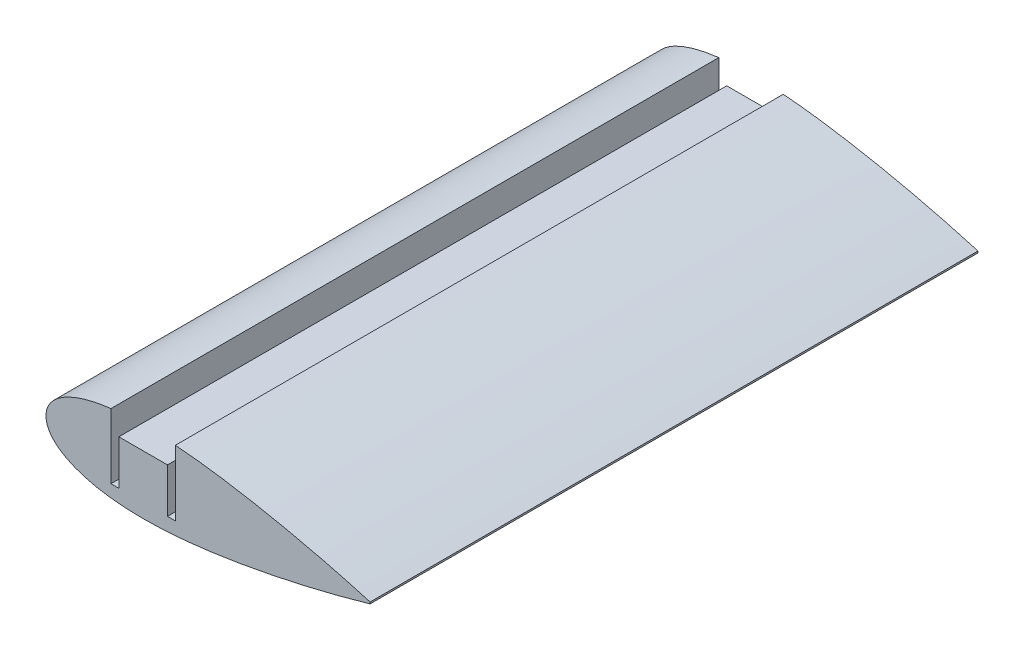
ISO-10303-21;
HEADER;
FILE_DESCRIPTION(('STEP AP214'),'2;1');
FILE_NAME('part.step','',(''),(''),'','','');
FILE_SCHEMA(('AUTOMOTIVE_DESIGN { 1 0 10303 214 1 1 1 1 }'));
ENDSEC;
DATA;
#1=APPLICATION_CONTEXT('core data for automotive mechanical design processes');
#2=APPLICATION_PROTOCOL_DEFINITION('international standard','automotive_design',2000,#1);
#3=PRODUCT_CONTEXT('',#1,'mechanical');
#4=PRODUCT('Part','Part','',(#3));
#5=PRODUCT_RELATED_PRODUCT_CATEGORY('part','',(#4));
#6=PRODUCT_DEFINITION_FORMATION('','',#4);
#7=PRODUCT_DEFINITION_CONTEXT('part definition',#1,'design');
#8=PRODUCT_DEFINITION('design','',#6,#7);
#9=PRODUCT_DEFINITION_SHAPE('','',#8);
#10=(LENGTH_UNIT() NAMED_UNIT(*) SI_UNIT(.MILLI.,.METRE.));
#11=(NAMED_UNIT(*) PLANE_ANGLE_UNIT() SI_UNIT($,.RADIAN.));
#12=(NAMED_UNIT(*) SI_UNIT($,.STERADIAN.) SOLID_ANGLE_UNIT());
#13=UNCERTAINTY_MEASURE_WITH_UNIT(LENGTH_MEASURE(1.E-05),#10,'distance_accuracy_value','');
#14=(GEOMETRIC_REPRESENTATION_CONTEXT(3) GLOBAL_UNCERTAINTY_ASSIGNED_CONTEXT((#13)) GLOBAL_UNIT_ASSIGNED_CONTEXT((#10,
#11,#12)) REPRESENTATION_CONTEXT('',''));
#15=CARTESIAN_POINT('',(0.,0.,0.));
#16=DIRECTION('',(0.,0.,1.));
#17=DIRECTION('',(1.,0.,0.));
#18=AXIS2_PLACEMENT_3D('',#15,#16,#17);
#19=CARTESIAN_POINT('',(55.9989919193493,0.209938863085076,150.));
#20=CARTESIAN_POINT('',(53.4638964966378,0.950455213569446,150.));
#21=CARTESIAN_POINT('',(48.8039042583549,2.23387389684317,150.));
#22=CARTESIAN_POINT('',(42.4289239083546,3.81993488404164,150.));
#23=CARTESIAN_POINT('',(36.7433768309172,5.12087345257297,150.));
#24=CARTESIAN_POINT('',(31.199749361999,6.28724939568446,150.));
#25=CARTESIAN_POINT('',(25.282426202672,7.40748841907212,150.));
#26=CARTESIAN_POINT('',(20.1764843732921,8.24523101459941,150.));
#27=CARTESIAN_POINT('',(14.9796239544358,8.97488730570402,150.));
#28=CARTESIAN_POINT('',(10.821499068855,9.448623319597,150.));
#29=CARTESIAN_POINT('',(6.69735098701538,9.77702289368401,150.));
#30=CARTESIAN_POINT('',(3.68065560441313,9.9396226054484,150.));
#31=CARTESIAN_POINT('',(0.739619612666901,10.0126657259053,150.));
#32=CARTESIAN_POINT('',(-2.10775121270018,9.99002894364164,150.));
#33=CARTESIAN_POINT('',(-4.84394170477697,9.86696098204471,150.));
#34=CARTESIAN_POINT('',(-7.45218804783977,9.64089989695852,150.));
#35=CARTESIAN_POINT('',(-9.91647870541163,9.31063074400066,150.));
#36=CARTESIAN_POINT('',(-12.2217517660549,8.87722299298465,150.));
#37=CARTESIAN_POINT('',(-14.3540217517739,8.3436594333454,150.));
#38=CARTESIAN_POINT('',(-16.3004013447247,7.71434115945919,150.));
#39=CARTESIAN_POINT('',(-18.0493555178327,6.99539951409285,150.));
#40=CARTESIAN_POINT('',(-19.5906051636423,6.19339349001841,150.));
#41=CARTESIAN_POINT('',(-20.9154102376862,5.31556202706807,150.));
#42=CARTESIAN_POINT('',(-22.0158536973899,4.36806482887196,150.));
#43=CARTESIAN_POINT('',(-22.8849211839651,3.3564916522408,150.));
#44=CARTESIAN_POINT('',(-23.5144514570847,2.28497610959955,150.));
#45=CARTESIAN_POINT('',(-23.8953726240987,1.15878899111641,150.));
#46=CARTESIAN_POINT('',(-24.0186796636969,-1.75908521777257E-13,150.));
#47=CARTESIAN_POINT('',(-23.8953726240988,-1.15878899111675,150.));
#48=CARTESIAN_POINT('',(-23.5144514570847,-2.28497610959989,150.));
#49=CARTESIAN_POINT('',(-22.884921183965,-3.35649165224111,150.));
#50=CARTESIAN_POINT('',(-22.0158536973898,-4.36806482887224,150.));
#51=CARTESIAN_POINT('',(-20.915410237686,-5.3155620270683,150.));
#52=CARTESIAN_POINT('',(-19.5906051636421,-6.19339349001866,150.));
#53=CARTESIAN_POINT('',(-18.0493555178326,-6.99539951409303,150.));
#54=CARTESIAN_POINT('',(-16.3004013447245,-7.7143411594593,150.));
#55=CARTESIAN_POINT('',(-14.3540217517738,-8.34365943334548,150.));
#56=CARTESIAN_POINT('',(-12.2217517660546,-8.87722299298468,150.));
#57=CARTESIAN_POINT('',(-9.91647870541153,-9.31063074400058,150.));
#58=CARTESIAN_POINT('',(-7.45218804783928,-9.64089989695837,150.));
#59=CARTESIAN_POINT('',(-4.84394170477671,-9.86696098204449,150.));
#60=CARTESIAN_POINT('',(-2.10775121269992,-9.9900289436414,150.));
#61=CARTESIAN_POINT('',(0.739619612667124,-10.0126657259049,150.));
#62=CARTESIAN_POINT('',(3.68065560441341,-9.93962260544802,150.));
#63=CARTESIAN_POINT('',(7.74070186985012,-9.72078633967261,150.));
#64=CARTESIAN_POINT('',(12.9128329822487,-9.24133423758695,150.));
#65=CARTESIAN_POINT('',(19.1366713132933,-8.41575446947586,150.));
#66=CARTESIAN_POINT('',(25.2824253698515,-7.40744897655412,150.));
#67=CARTESIAN_POINT('',(31.1997526672966,-6.28725230429911,150.));
#68=CARTESIAN_POINT('',(37.5171609466784,-4.95809921986488,150.));
#69=CARTESIAN_POINT('',(44.7425708724751,-3.27585727198836,150.));
#70=CARTESIAN_POINT('',(51.057566094569,-1.62626062854624,150.));
#71=CARTESIAN_POINT('',(54.9450257220016,-0.517808616230064,150.));
#72=CARTESIAN_POINT('',(55.9579115196256,-0.221938690548135,150.));
#73=CARTESIAN_POINT('',(55.9989919193493,-0.209938863083146,150.));
#74=B_SPLINE_CURVE_WITH_KNOTS('',3,(#19,#20,#21,#22,#23,#24,#25,#26,#27,#28,#29,#30,#31,#32,#33,
#34,#35,#36,#37,#38,#39,#40,#41,#42,#43,#44,#45,#46,#47,#48,#49,#50,#51,#52,#53,#54,#55,#56,#57,
#58,#59,#60,#61,#62,#63,#64,#65,#66,#67,#68,#69,#70,#71,#72,#73),.UNSPECIFIED.,.F.,.F.,(4,1,1,1,
1,1,1,1,1,1,1,1,1,1,1,1,1,1,1,1,1,1,1,1,1,1,1,1,1,1,1,1,1,1,1,1,1,1,1,1,1,1,1,1,1,1,1,1,1,1,1,1,
4),(0.,0.046554702548103,0.0851933723553801,0.115793222339596,0.149362634078918,0.1850479898127,
0.221946042476896,0.240561294663547,0.277549679499533,0.295701184971201,0.313482549842361,
0.330796889450606,0.347551895237421,0.36366584186233,0.379065349030513,0.393686065347915,
0.407475418245897,0.42039193375361,0.432405656844922,0.443502805927447,0.45368642125852,
0.462984388050073,0.471455944432899,0.479204464756735,0.48638826860332,0.493228973887645,0.5,
0.506771026112355,0.51361173139668,0.520795535243265,0.528544055567101,0.537015611949927,
0.54631357874148,0.556497194072553,0.567594343155078,0.579608066246389,0.592524581754103,
0.606313934652085,0.620934650969486,0.63633415813767,0.652448104762579,0.669203110549394,
0.686517450157639,0.704298815028799,0.740866340835607,0.778053957523103,0.8149520101873,
0.850637365921082,0.884206777660403,0.928744289385696,0.981399281225805,0.999245596133163,1.),.UNSPECIFIED.);
#75=DIRECTION('',(0.,0.,-1.));
#76=VECTOR('',#75,1.);
#77=SURFACE_OF_LINEAR_EXTRUSION('',#74,#76);
#78=CARTESIAN_POINT('',(55.9989919193493,0.209938863085076,0.));
#79=CARTESIAN_POINT('',(53.4638964966378,0.950455213569446,0.));
#80=CARTESIAN_POINT('',(48.8039042583549,2.23387389684317,0.));
#81=CARTESIAN_POINT('',(42.4289239083546,3.81993488404164,0.));
#82=CARTESIAN_POINT('',(36.7433768309172,5.12087345257297,0.));
#83=CARTESIAN_POINT('',(31.199749361999,6.28724939568446,0.));
#84=CARTESIAN_POINT('',(25.282426202672,7.40748841907212,0.));
#85=CARTESIAN_POINT('',(20.1764843732921,8.24523101459941,0.));
#86=CARTESIAN_POINT('',(14.9796239544358,8.97488730570402,0.));
#87=CARTESIAN_POINT('',(10.821499068855,9.448623319597,0.));
#88=CARTESIAN_POINT('',(6.69735098701538,9.77702289368401,0.));
#89=CARTESIAN_POINT('',(3.68065560441313,9.9396226054484,0.));
#90=CARTESIAN_POINT('',(0.739619612666901,10.0126657259053,0.));
#91=CARTESIAN_POINT('',(-2.10775121270018,9.99002894364164,0.));
#92=CARTESIAN_POINT('',(-4.84394170477697,9.86696098204471,0.));
#93=CARTESIAN_POINT('',(-7.45218804783977,9.64089989695852,0.));
#94=CARTESIAN_POINT('',(-9.91647870541163,9.31063074400066,0.));
#95=CARTESIAN_POINT('',(-12.2217517660549,8.87722299298465,0.));
#96=CARTESIAN_POINT('',(-14.3540217517739,8.3436594333454,0.));
#97=CARTESIAN_POINT('',(-16.3004013447247,7.71434115945919,0.));
#98=CARTESIAN_POINT('',(-18.0493555178327,6.99539951409285,0.));
#99=CARTESIAN_POINT('',(-19.5906051636423,6.19339349001841,0.));
#100=CARTESIAN_POINT('',(-20.9154102376862,5.31556202706807,0.));
#101=CARTESIAN_POINT('',(-22.0158536973899,4.36806482887196,0.));
#102=CARTESIAN_POINT('',(-22.8849211839651,3.3564916522408,0.));
#103=CARTESIAN_POINT('',(-23.5144514570847,2.28497610959955,0.));
#104=CARTESIAN_POINT('',(-23.8953726240987,1.15878899111641,0.));
#105=CARTESIAN_POINT('',(-24.0186796636969,-1.75908521777257E-13,0.));
#106=CARTESIAN_POINT('',(-23.8953726240988,-1.15878899111675,0.));
#107=CARTESIAN_POINT('',(-23.5144514570847,-2.28497610959989,0.));
#108=CARTESIAN_POINT('',(-22.884921183965,-3.35649165224111,0.));
#109=CARTESIAN_POINT('',(-22.0158536973898,-4.36806482887224,0.));
#110=CARTESIAN_POINT('',(-20.915410237686,-5.3155620270683,0.));
#111=CARTESIAN_POINT('',(-19.5906051636421,-6.19339349001866,0.));
#112=CARTESIAN_POINT('',(-18.0493555178326,-6.99539951409303,0.));
#113=CARTESIAN_POINT('',(-16.3004013447245,-7.7143411594593,0.));
#114=CARTESIAN_POINT('',(-14.3540217517738,-8.34365943334548,0.));
#115=CARTESIAN_POINT('',(-12.2217517660546,-8.87722299298468,0.));
#116=CARTESIAN_POINT('',(-9.91647870541153,-9.31063074400058,0.));
#117=CARTESIAN_POINT('',(-7.45218804783928,-9.64089989695837,0.));
#118=CARTESIAN_POINT('',(-4.84394170477671,-9.86696098204449,0.));
#119=CARTESIAN_POINT('',(-2.10775121269992,-9.9900289436414,0.));
#120=CARTESIAN_POINT('',(0.739619612667124,-10.0126657259049,0.));
#121=CARTESIAN_POINT('',(3.68065560441341,-9.93962260544802,0.));
#122=CARTESIAN_POINT('',(7.74070186985012,-9.72078633967261,0.));
#123=CARTESIAN_POINT('',(12.9128329822487,-9.24133423758695,0.));
#124=CARTESIAN_POINT('',(19.1366713132933,-8.41575446947586,0.));
#125=CARTESIAN_POINT('',(25.2824253698515,-7.40744897655412,0.));
#126=CARTESIAN_POINT('',(31.1997526672966,-6.28725230429911,0.));
#127=CARTESIAN_POINT('',(37.5171609466784,-4.95809921986488,0.));
#128=CARTESIAN_POINT('',(44.7425708724751,-3.27585727198836,0.));
#129=CARTESIAN_POINT('',(51.057566094569,-1.62626062854624,0.));
#130=CARTESIAN_POINT('',(54.9450257220016,-0.517808616230064,0.));
#131=CARTESIAN_POINT('',(55.9579115196256,-0.221938690548135,0.));
#132=CARTESIAN_POINT('',(55.9989919193493,-0.209938863083146,0.));
#133=B_SPLINE_CURVE_WITH_KNOTS('',3,(#78,#79,#80,#81,#82,#83,#84,#85,#86,#87,#88,#89,#90,#91,
#92,#93,#94,#95,#96,#97,#98,#99,#100,#101,#102,#103,#104,#105,#106,#107,#108,#109,#110,#111,
#112,#113,#114,#115,#116,#117,#118,#119,#120,#121,#122,#123,#124,#125,#126,#127,#128,#129,#130,
#131,#132),.UNSPECIFIED.,.F.,.F.,(4,1,1,1,1,1,1,1,1,1,1,1,1,1,1,1,1,1,1,1,1,1,1,1,1,1,1,1,1,1,1,
1,1,1,1,1,1,1,1,1,1,1,1,1,1,1,1,1,1,1,1,1,4),(0.,0.046554702548103,0.0851933723553801,
0.115793222339596,0.149362634078918,0.1850479898127,0.221946042476896,0.240561294663547,
0.277549679499533,0.295701184971201,0.313482549842361,0.330796889450606,0.347551895237421,
0.36366584186233,0.379065349030513,0.393686065347915,0.407475418245897,0.42039193375361,
0.432405656844922,0.443502805927447,0.45368642125852,0.462984388050073,0.471455944432899,
0.479204464756735,0.48638826860332,0.493228973887645,0.5,0.506771026112355,0.51361173139668,
0.520795535243265,0.528544055567101,0.537015611949927,0.54631357874148,0.556497194072553,
0.567594343155078,0.579608066246389,0.592524581754103,0.606313934652085,0.620934650969486,
0.63633415813767,0.652448104762579,0.669203110549394,0.686517450157639,0.704298815028799,
0.740866340835607,0.778053957523103,0.8149520101873,0.850637365921082,0.884206777660403,
0.928744289385696,0.981399281225805,0.999245596133163,1.),.UNSPECIFIED.);
#134=CARTESIAN_POINT('',(55.9989919193493,0.209938863085006,0.));
#135=VERTEX_POINT('',#134);
#136=CARTESIAN_POINT('',(7.95,9.67376392846105,0.));
#137=VERTEX_POINT('',#136);
#138=EDGE_CURVE('E91',#135,#137,#133,.T.);
#139=ORIENTED_EDGE('',*,*,#138,.T.);
#140=DIRECTION('',(0.,0.,-1.));
#141=VECTOR('',#140,1.);
#142=CARTESIAN_POINT('',(7.95,9.67376392846105,75.0005));
#143=LINE('',#142,#141);
#144=CARTESIAN_POINT('',(7.95000022217772,9.67320604176941,150.));
#145=VERTEX_POINT('',#144);
#146=EDGE_CURVE('E305',#145,#137,#143,.T.);
#147=ORIENTED_EDGE('',*,*,#146,.F.);
#148=CARTESIAN_POINT('',(7.95004296781648,9.67376061658568,150.));
#149=CARTESIAN_POINT('',(8.55206981624657,9.62735745972923,150.));
#150=CARTESIAN_POINT('',(11.2447846059229,9.40039831227111,150.));
#151=CARTESIAN_POINT('',(14.9796239544358,8.97488730570402,150.));
#152=CARTESIAN_POINT('',(20.1764843732921,8.24523101459941,150.));
#153=CARTESIAN_POINT('',(25.282426202672,7.40748841907212,150.));
#154=CARTESIAN_POINT('',(31.199749361999,6.28724939568446,150.));
#155=CARTESIAN_POINT('',(36.7433768309172,5.12087345257297,150.));
#156=CARTESIAN_POINT('',(42.4289239083546,3.81993488404164,150.));
#157=CARTESIAN_POINT('',(48.8039042583549,2.23387389684317,150.));
#158=CARTESIAN_POINT('',(53.4638964966378,0.950455213569446,150.));
#159=CARTESIAN_POINT('',(55.9989919193493,0.209938863085076,150.));
#160=B_SPLINE_CURVE_WITH_KNOTS('',3,(#148,#149,#150,#151,#152,#153,#154,#155,#156,#157,#158,
#159),.UNSPECIFIED.,.F.,.F.,(4,1,1,1,1,1,1,1,1,4),(0.,0.0106434373012104,0.0476318221371959,
0.0662470743238466,0.103145126988043,0.138830482721825,0.172399894461147,0.202999744445363,
0.24163841425264,0.288193116800743),.UNSPECIFIED.);
#161=CARTESIAN_POINT('',(55.9989919193493,0.209938863085006,150.));
#162=VERTEX_POINT('',#161);
#163=EDGE_CURVE('E97',#162,#145,#160,.F.);
#164=ORIENTED_EDGE('',*,*,#163,.F.);
#165=DIRECTION('',(0.,0.,-1.));
#166=VECTOR('',#165,1.);
#167=CARTESIAN_POINT('',(55.9989919193493,0.209938863085006,150.));
#168=LINE('',#167,#166);
#169=EDGE_CURVE('E53',#162,#135,#168,.T.);
#170=ORIENTED_EDGE('',*,*,#169,.T.);
#171=EDGE_LOOP('',(#139,#147,#164,#170));
#172=FACE_BOUND('',#171,.T.);
#173=ADVANCED_FACE('F41',(#172),#77,.F.);
#174=CARTESIAN_POINT('',(55.9989919193493,-0.209938863083146,150.));
#175=CARTESIAN_POINT('',(55.9579115196256,-0.221938690548135,150.));
#176=CARTESIAN_POINT('',(54.9450257220016,-0.517808616230064,150.));
#177=CARTESIAN_POINT('',(51.057566094569,-1.62626062854624,150.));
#178=CARTESIAN_POINT('',(44.7425708724751,-3.27585727198836,150.));
#179=CARTESIAN_POINT('',(37.5171609466784,-4.95809921986488,150.));
#180=CARTESIAN_POINT('',(31.1997526672966,-6.28725230429911,150.));
#181=CARTESIAN_POINT('',(25.2824253698515,-7.40744897655412,150.));
#182=CARTESIAN_POINT('',(19.1366713132933,-8.41575446947586,150.));
#183=CARTESIAN_POINT('',(12.9128329822487,-9.24133423758695,150.));
#184=CARTESIAN_POINT('',(7.74070186985012,-9.72078633967261,150.));
#185=CARTESIAN_POINT('',(3.68065560441341,-9.93962260544802,150.));
#186=CARTESIAN_POINT('',(0.739619612667124,-10.0126657259049,150.));
#187=CARTESIAN_POINT('',(-2.10775121269992,-9.9900289436414,150.));
#188=CARTESIAN_POINT('',(-4.84394170477671,-9.86696098204449,150.));
#189=CARTESIAN_POINT('',(-7.45218804783928,-9.64089989695837,150.));
#190=CARTESIAN_POINT('',(-9.91647870541153,-9.31063074400058,150.));
#191=CARTESIAN_POINT('',(-12.2217517660546,-8.87722299298468,150.));
#192=CARTESIAN_POINT('',(-14.3540217517738,-8.34365943334548,150.));
#193=CARTESIAN_POINT('',(-16.3004013447245,-7.7143411594593,150.));
#194=CARTESIAN_POINT('',(-18.0493555178326,-6.99539951409303,150.));
#195=CARTESIAN_POINT('',(-19.5906051636421,-6.19339349001866,150.));
#196=CARTESIAN_POINT('',(-20.915410237686,-5.3155620270683,150.));
#197=CARTESIAN_POINT('',(-22.0158536973898,-4.36806482887224,150.));
#198=CARTESIAN_POINT('',(-22.884921183965,-3.35649165224111,150.));
#199=CARTESIAN_POINT('',(-23.5144514570847,-2.28497610959989,150.));
#200=CARTESIAN_POINT('',(-23.8953726240988,-1.15878899111675,150.));
#201=CARTESIAN_POINT('',(-24.0186796636969,-1.75908521777257E-13,150.));
#202=CARTESIAN_POINT('',(-23.8953726240987,1.15878899111641,150.));
#203=CARTESIAN_POINT('',(-23.5144514570847,2.28497610959955,150.));
#204=CARTESIAN_POINT('',(-22.8849211839651,3.3564916522408,150.));
#205=CARTESIAN_POINT('',(-22.0158536973899,4.36806482887196,150.));
#206=CARTESIAN_POINT('',(-20.9154102376862,5.31556202706807,150.));
#207=CARTESIAN_POINT('',(-19.5906051636423,6.19339349001841,150.));
#208=CARTESIAN_POINT('',(-18.0493555178327,6.99539951409285,150.));
#209=CARTESIAN_POINT('',(-16.3004013447247,7.71434115945919,150.));
#210=CARTESIAN_POINT('',(-14.3540217517739,8.3436594333454,150.));
#211=CARTESIAN_POINT('',(-12.2217517660549,8.87722299298465,150.));
#212=CARTESIAN_POINT('',(-10.0669225668256,9.2823462267594,150.));
#213=CARTESIAN_POINT('',(-8.62170436038093,9.48338797999524,150.));
#214=CARTESIAN_POINT('',(-7.94998790313957,9.56370201604713,150.));
#215=B_SPLINE_CURVE_WITH_KNOTS('',3,(#174,#175,#176,#177,#178,#179,#180,#181,#182,#183,#184,
#185,#186,#187,#188,#189,#190,#191,#192,#193,#194,#195,#196,#197,#198,#199,#200,#201,#202,#203,
#204,#205,#206,#207,#208,#209,#210,#211,#212,#213,#214),.UNSPECIFIED.,.F.,.F.,(4,1,1,1,1,1,1,1,
1,1,1,1,1,1,1,1,1,1,1,1,1,1,1,1,1,1,1,1,1,1,1,1,1,1,1,1,1,1,4),(0.381762353168956,
0.382516757035792,0.40036307194315,0.453018063783259,0.497555575508552,0.531124987247873,
0.566810342981656,0.603708395645852,0.640896012333348,0.677463538140157,0.695244903011317,
0.712559242619562,0.729314248406377,0.745428195031286,0.760827702199469,0.775448418516871,
0.789237771414852,0.802154286922566,0.814168010013878,0.825265159096403,0.835448774427476,
0.844746741219029,0.853218297601854,0.860966817925691,0.868150621772276,0.8749913270566,
0.881762353168956,0.888533379281311,0.895374084565636,0.902557888412221,0.910306408736057,
0.918777965118882,0.928075931910435,0.938259547241509,0.949356696324034,0.961370419415345,
0.974286934923059,0.988076287821041,1.),.UNSPECIFIED.);
#216=CARTESIAN_POINT('',(-7.9499999621112,9.56378591811171,150.000165217242));
#217=VERTEX_POINT('',#216);
#218=CARTESIAN_POINT('',(55.9989919193493,-0.209938863083216,150.));
#219=VERTEX_POINT('',#218);
#220=EDGE_CURVE('E90',#217,#219,#215,.F.);
#221=ORIENTED_EDGE('',*,*,#220,.F.);
#222=DIRECTION('',(0.,0.,-1.));
#223=VECTOR('',#222,1.);
#224=CARTESIAN_POINT('',(-7.94999999999999,9.56370056967996,75.0005));
#225=LINE('',#224,#223);
#226=CARTESIAN_POINT('',(-7.94999999999999,9.56370056967996,0.));
#227=VERTEX_POINT('',#226);
#228=EDGE_CURVE('E306',#217,#227,#225,.T.);
#229=ORIENTED_EDGE('',*,*,#228,.T.);
#230=CARTESIAN_POINT('',(55.9989919193493,-0.209938863083216,0.));
#231=VERTEX_POINT('',#230);
#232=EDGE_CURVE('E105',#227,#231,#133,.T.);
#233=ORIENTED_EDGE('',*,*,#232,.T.);
#234=DIRECTION('',(0.,0.,-1.));
#235=VECTOR('',#234,1.);
#236=CARTESIAN_POINT('',(55.9989919193493,-0.209938863083216,150.));
#237=LINE('',#236,#235);
#238=EDGE_CURVE('E11',#219,#231,#237,.T.);
#239=ORIENTED_EDGE('',*,*,#238,.F.);
#240=EDGE_LOOP('',(#221,#229,#233,#239));
#241=FACE_BOUND('',#240,.T.);
#242=ADVANCED_FACE('F43',(#241),#77,.F.);
#243=CARTESIAN_POINT('',(55.9989919193493,0.209938863085006,150.));
#244=DIRECTION('',(-1.,0.,0.));
#245=DIRECTION('',(0.,0.,1.));
#246=AXIS2_PLACEMENT_3D('',#243,#244,#245);
#247=PLANE('',#246);
#248=DIRECTION('',(0.,1.,0.));
#249=VECTOR('',#248,1.);
#250=CARTESIAN_POINT('',(55.9989919193493,0.209938863085006,0.));
#251=LINE('',#250,#249);
#252=EDGE_CURVE('E82',#231,#135,#251,.T.);
#253=ORIENTED_EDGE('',*,*,#252,.T.);
#254=ORIENTED_EDGE('',*,*,#169,.F.);
#255=DIRECTION('',(0.,1.,0.));
#256=VECTOR('',#255,1.);
#257=CARTESIAN_POINT('',(55.9989919193493,0.209938863085006,150.));
#258=LINE('',#257,#256);
#259=EDGE_CURVE('E70',#219,#162,#258,.T.);
#260=ORIENTED_EDGE('',*,*,#259,.F.);
#261=ORIENTED_EDGE('',*,*,#238,.T.);
#262=EDGE_LOOP('',(#253,#254,#260,#261));
#263=FACE_BOUND('',#262,.T.);
#264=ADVANCED_FACE('F84',(#263),#247,.F.);
#265=CARTESIAN_POINT('',(-23.9777178269784,-1.93472177114595E-13,150.));
#266=DIRECTION('',(0.,0.,-1.));
#267=DIRECTION('',(-1.,0.,0.));
#268=AXIS2_PLACEMENT_3D('',#265,#266,#267);
#269=PLANE('',#268);
#270=ORIENTED_EDGE('',*,*,#163,.T.);
#271=DIRECTION('',(0.,1.,0.));
#272=VECTOR('',#271,1.);
#273=CARTESIAN_POINT('',(7.95,-6.49999999999986,150.));
#274=LINE('',#273,#272);
#275=CARTESIAN_POINT('',(7.95,-6.49999999999986,150.));
#276=VERTEX_POINT('',#275);
#277=EDGE_CURVE('E275',#276,#145,#274,.T.);
#278=ORIENTED_EDGE('',*,*,#277,.F.);
#279=DIRECTION('',(1.,0.,0.));
#280=VECTOR('',#279,1.);
#281=CARTESIAN_POINT('',(6.,-6.49999999999986,150.));
#282=LINE('',#281,#280);
#283=CARTESIAN_POINT('',(6.,-6.49999999999986,150.));
#284=VERTEX_POINT('',#283);
#285=EDGE_CURVE('E272',#284,#276,#282,.T.);
#286=ORIENTED_EDGE('',*,*,#285,.F.);
#287=DIRECTION('',(0.,-1.,0.));
#288=VECTOR('',#287,1.);
#289=CARTESIAN_POINT('',(6.,-6.49999999999986,150.));
#290=LINE('',#289,#288);
#291=CARTESIAN_POINT('',(6.,4.50000000000014,150.));
#292=VERTEX_POINT('',#291);
#293=EDGE_CURVE('E263',#292,#284,#290,.T.);
#294=ORIENTED_EDGE('',*,*,#293,.F.);
#295=DIRECTION('',(1.,0.,0.));
#296=VECTOR('',#295,1.);
#297=CARTESIAN_POINT('',(6.,4.50000000000014,150.));
#298=LINE('',#297,#296);
#299=CARTESIAN_POINT('',(-6.,4.50000000000014,150.));
#300=VERTEX_POINT('',#299);
#301=EDGE_CURVE('E260',#300,#292,#298,.T.);
#302=ORIENTED_EDGE('',*,*,#301,.F.);
#303=DIRECTION('',(0.,1.,0.));
#304=VECTOR('',#303,1.);
#305=CARTESIAN_POINT('',(-6.,-6.49999999999986,150.));
#306=LINE('',#305,#304);
#307=CARTESIAN_POINT('',(-6.,-6.49999999999986,150.));
#308=VERTEX_POINT('',#307);
#309=EDGE_CURVE('E253',#308,#300,#306,.T.);
#310=ORIENTED_EDGE('',*,*,#309,.F.);
#311=DIRECTION('',(1.,0.,0.));
#312=VECTOR('',#311,1.);
#313=CARTESIAN_POINT('',(-6.,-6.49999999999986,150.));
#314=LINE('',#313,#312);
#315=CARTESIAN_POINT('',(-7.95,-6.49999999999986,150.));
#316=VERTEX_POINT('',#315);
#317=EDGE_CURVE('E107',#316,#308,#314,.T.);
#318=ORIENTED_EDGE('',*,*,#317,.F.);
#319=DIRECTION('',(0.,-1.,0.));
#320=VECTOR('',#319,1.);
#321=CARTESIAN_POINT('',(-7.95,-6.49999999999986,150.));
#322=LINE('',#321,#320);
#323=EDGE_CURVE('E261',#217,#316,#322,.T.);
#324=ORIENTED_EDGE('',*,*,#323,.F.);
#325=ORIENTED_EDGE('',*,*,#220,.T.);
#326=ORIENTED_EDGE('',*,*,#259,.T.);
#327=EDGE_LOOP('',(#270,#278,#286,#294,#302,#310,#318,#324,#325,#326));
#328=FACE_BOUND('',#327,.T.);
#329=ADVANCED_FACE('F124',(#328),#269,.F.);
#330=CARTESIAN_POINT('',(-23.9777178269784,-1.93472177114595E-13,0.));
#331=DIRECTION('',(0.,0.,-1.));
#332=DIRECTION('',(-1.,0.,0.));
#333=AXIS2_PLACEMENT_3D('',#330,#331,#332);
#334=PLANE('',#333);
#335=DIRECTION('',(0.,-1.,0.));
#336=VECTOR('',#335,1.);
#337=CARTESIAN_POINT('',(7.95,-6.49999999999986,0.));
#338=LINE('',#337,#336);
#339=CARTESIAN_POINT('',(7.95,-6.49999999999986,0.));
#340=VERTEX_POINT('',#339);
#341=EDGE_CURVE('E104',#137,#340,#338,.T.);
#342=ORIENTED_EDGE('',*,*,#341,.F.);
#343=ORIENTED_EDGE('',*,*,#138,.F.);
#344=ORIENTED_EDGE('',*,*,#252,.F.);
#345=ORIENTED_EDGE('',*,*,#232,.F.);
#346=DIRECTION('',(0.,1.,0.));
#347=VECTOR('',#346,1.);
#348=CARTESIAN_POINT('',(-7.95,-6.49999999999986,0.));
#349=LINE('',#348,#347);
#350=CARTESIAN_POINT('',(-7.95,-6.49999999999986,0.));
#351=VERTEX_POINT('',#350);
#352=EDGE_CURVE('E283',#351,#227,#349,.T.);
#353=ORIENTED_EDGE('',*,*,#352,.F.);
#354=DIRECTION('',(-1.,0.,0.));
#355=VECTOR('',#354,1.);
#356=CARTESIAN_POINT('',(-6.,-6.49999999999986,0.));
#357=LINE('',#356,#355);
#358=CARTESIAN_POINT('',(-6.,-6.49999999999986,0.));
#359=VERTEX_POINT('',#358);
#360=EDGE_CURVE('E281',#359,#351,#357,.T.);
#361=ORIENTED_EDGE('',*,*,#360,.F.);
#362=DIRECTION('',(0.,-1.,0.));
#363=VECTOR('',#362,1.);
#364=CARTESIAN_POINT('',(-6.,-6.49999999999986,0.));
#365=LINE('',#364,#363);
#366=CARTESIAN_POINT('',(-6.,4.50000000000014,0.));
#367=VERTEX_POINT('',#366);
#368=EDGE_CURVE('E61',#367,#359,#365,.T.);
#369=ORIENTED_EDGE('',*,*,#368,.F.);
#370=DIRECTION('',(-1.,0.,0.));
#371=VECTOR('',#370,1.);
#372=CARTESIAN_POINT('',(6.,4.50000000000014,0.));
#373=LINE('',#372,#371);
#374=CARTESIAN_POINT('',(6.,4.50000000000014,0.));
#375=VERTEX_POINT('',#374);
#376=EDGE_CURVE('E255',#375,#367,#373,.T.);
#377=ORIENTED_EDGE('',*,*,#376,.F.);
#378=DIRECTION('',(0.,1.,0.));
#379=VECTOR('',#378,1.);
#380=CARTESIAN_POINT('',(6.,-6.49999999999986,0.));
#381=LINE('',#380,#379);
#382=CARTESIAN_POINT('',(6.,-6.49999999999986,0.));
#383=VERTEX_POINT('',#382);
#384=EDGE_CURVE('E290',#383,#375,#381,.T.);
#385=ORIENTED_EDGE('',*,*,#384,.F.);
#386=DIRECTION('',(-1.,0.,0.));
#387=VECTOR('',#386,1.);
#388=CARTESIAN_POINT('',(6.,-6.49999999999986,0.));
#389=LINE('',#388,#387);
#390=EDGE_CURVE('E287',#340,#383,#389,.T.);
#391=ORIENTED_EDGE('',*,*,#390,.F.);
#392=EDGE_LOOP('',(#342,#343,#344,#345,#353,#361,#369,#377,#385,#391));
#393=FACE_BOUND('',#392,.T.);
#394=ADVANCED_FACE('F101',(#393),#334,.T.);
#395=CARTESIAN_POINT('',(-6.,-6.49999999999986,150.001));
#396=DIRECTION('',(1.,0.,0.));
#397=DIRECTION('',(0.,1.,0.));
#398=AXIS2_PLACEMENT_3D('',#395,#396,#397);
#399=PLANE('',#398);
#400=ORIENTED_EDGE('',*,*,#309,.T.);
#401=DIRECTION('',(0.,0.,-1.));
#402=VECTOR('',#401,1.);
#403=CARTESIAN_POINT('',(-6.,4.50000000000014,150.001));
#404=LINE('',#403,#402);
#405=EDGE_CURVE('E251',#300,#367,#404,.T.);
#406=ORIENTED_EDGE('',*,*,#405,.T.);
#407=ORIENTED_EDGE('',*,*,#368,.T.);
#408=DIRECTION('',(0.,0.,-1.));
#409=VECTOR('',#408,1.);
#410=CARTESIAN_POINT('',(-6.,-6.49999999999986,150.001));
#411=LINE('',#410,#409);
#412=EDGE_CURVE('E242',#308,#359,#411,.T.);
#413=ORIENTED_EDGE('',*,*,#412,.F.);
#414=EDGE_LOOP('',(#400,#406,#407,#413));
#415=FACE_BOUND('',#414,.T.);
#416=ADVANCED_FACE('F134',(#415),#399,.F.);
#417=CARTESIAN_POINT('',(6.,4.50000000000014,150.001));
#418=DIRECTION('',(0.,-1.,0.));
#419=DIRECTION('',(1.,0.,0.));
#420=AXIS2_PLACEMENT_3D('',#417,#418,#419);
#421=PLANE('',#420);
#422=ORIENTED_EDGE('',*,*,#301,.T.);
#423=DIRECTION('',(0.,0.,-1.));
#424=VECTOR('',#423,1.);
#425=CARTESIAN_POINT('',(6.,4.50000000000014,150.001));
#426=LINE('',#425,#424);
#427=EDGE_CURVE('E296',#292,#375,#426,.T.);
#428=ORIENTED_EDGE('',*,*,#427,.T.);
#429=ORIENTED_EDGE('',*,*,#376,.T.);
#430=ORIENTED_EDGE('',*,*,#405,.F.);
#431=EDGE_LOOP('',(#422,#428,#429,#430));
#432=FACE_BOUND('',#431,.T.);
#433=ADVANCED_FACE('F177',(#432),#421,.F.);
#434=CARTESIAN_POINT('',(6.,-6.49999999999986,150.001));
#435=DIRECTION('',(-1.,0.,0.));
#436=DIRECTION('',(0.,-1.,0.));
#437=AXIS2_PLACEMENT_3D('',#434,#435,#436);
#438=PLANE('',#437);
#439=ORIENTED_EDGE('',*,*,#293,.T.);
#440=DIRECTION('',(0.,0.,-1.));
#441=VECTOR('',#440,1.);
#442=CARTESIAN_POINT('',(6.,-6.49999999999986,150.001));
#443=LINE('',#442,#441);
#444=EDGE_CURVE('E299',#284,#383,#443,.T.);
#445=ORIENTED_EDGE('',*,*,#444,.T.);
#446=ORIENTED_EDGE('',*,*,#384,.T.);
#447=ORIENTED_EDGE('',*,*,#427,.F.);
#448=EDGE_LOOP('',(#439,#445,#446,#447));
#449=FACE_BOUND('',#448,.T.);
#450=ADVANCED_FACE('F185',(#449),#438,.F.);
#451=CARTESIAN_POINT('',(6.,-6.49999999999986,150.001));
#452=DIRECTION('',(0.,-1.,0.));
#453=DIRECTION('',(0.,0.,-1.));
#454=AXIS2_PLACEMENT_3D('',#451,#452,#453);
#455=PLANE('',#454);
#456=ORIENTED_EDGE('',*,*,#285,.T.);
#457=DIRECTION('',(0.,0.,-1.));
#458=VECTOR('',#457,1.);
#459=CARTESIAN_POINT('',(7.95,-6.49999999999986,150.001));
#460=LINE('',#459,#458);
#461=EDGE_CURVE('E302',#276,#340,#460,.T.);
#462=ORIENTED_EDGE('',*,*,#461,.T.);
#463=ORIENTED_EDGE('',*,*,#390,.T.);
#464=ORIENTED_EDGE('',*,*,#444,.F.);
#465=EDGE_LOOP('',(#456,#462,#463,#464));
#466=FACE_BOUND('',#465,.T.);
#467=ADVANCED_FACE('F195',(#466),#455,.F.);
#468=CARTESIAN_POINT('',(7.95,-6.49999999999986,150.001));
#469=DIRECTION('',(1.,0.,0.));
#470=DIRECTION('',(0.,1.,0.));
#471=AXIS2_PLACEMENT_3D('',#468,#469,#470);
#472=PLANE('',#471);
#473=ORIENTED_EDGE('',*,*,#277,.T.);
#474=ORIENTED_EDGE('',*,*,#146,.T.);
#475=ORIENTED_EDGE('',*,*,#341,.T.);
#476=ORIENTED_EDGE('',*,*,#461,.F.);
#477=EDGE_LOOP('',(#473,#474,#475,#476));
#478=FACE_BOUND('',#477,.T.);
#479=ADVANCED_FACE('F205',(#478),#472,.F.);
#480=CARTESIAN_POINT('',(-7.95,-6.49999999999986,150.001));
#481=DIRECTION('',(-1.,0.,0.));
#482=DIRECTION('',(0.,-1.,0.));
#483=AXIS2_PLACEMENT_3D('',#480,#481,#482);
#484=PLANE('',#483);
#485=ORIENTED_EDGE('',*,*,#323,.T.);
#486=DIRECTION('',(0.,0.,-1.));
#487=VECTOR('',#486,1.);
#488=CARTESIAN_POINT('',(-7.95,-6.49999999999986,150.001));
#489=LINE('',#488,#487);
#490=EDGE_CURVE('E246',#316,#351,#489,.T.);
#491=ORIENTED_EDGE('',*,*,#490,.T.);
#492=ORIENTED_EDGE('',*,*,#352,.T.);
#493=ORIENTED_EDGE('',*,*,#228,.F.);
#494=EDGE_LOOP('',(#485,#491,#492,#493));
#495=FACE_BOUND('',#494,.T.);
#496=ADVANCED_FACE('F215',(#495),#484,.F.);
#497=CARTESIAN_POINT('',(-6.,-6.49999999999986,150.001));
#498=DIRECTION('',(0.,-1.,0.));
#499=DIRECTION('',(0.,0.,-1.));
#500=AXIS2_PLACEMENT_3D('',#497,#498,#499);
#501=PLANE('',#500);
#502=ORIENTED_EDGE('',*,*,#317,.T.);
#503=ORIENTED_EDGE('',*,*,#412,.T.);
#504=ORIENTED_EDGE('',*,*,#360,.T.);
#505=ORIENTED_EDGE('',*,*,#490,.F.);
#506=EDGE_LOOP('',(#502,#503,#504,#505));
#507=FACE_BOUND('',#506,.T.);
#508=ADVANCED_FACE('F225',(#507),#501,.F.);
#509=CLOSED_SHELL('',(#173,#242,#264,#329,#394,#416,#433,#450,#467,#479,#496,#508));
#510=MANIFOLD_SOLID_BREP('B2',#509);
#511=ADVANCED_BREP_SHAPE_REPRESENTATION('',(#18,#510),#14);
#512=SHAPE_DEFINITION_REPRESENTATION(#9,#511);
ENDSEC;
END-ISO-10303-21;
